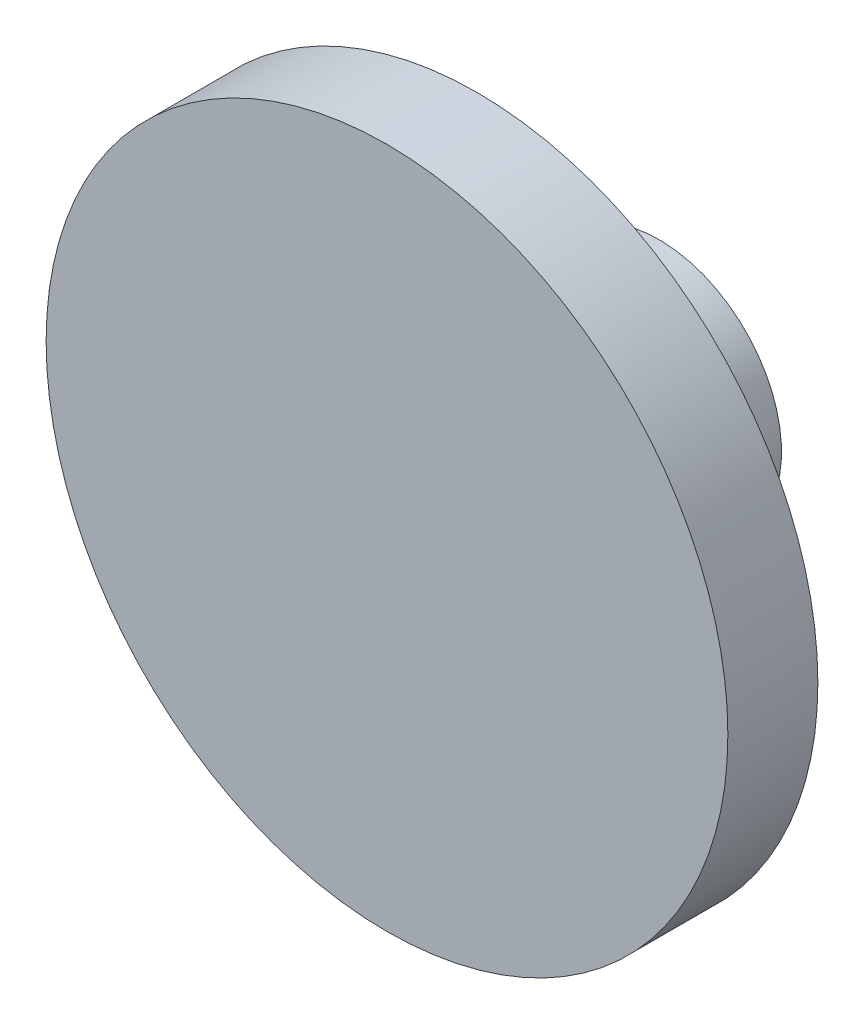
ISO-10303-21;
HEADER;
FILE_DESCRIPTION(('STEP AP214'),'2;1');
FILE_NAME('part.step','',(''),(''),'','','');
FILE_SCHEMA(('AUTOMOTIVE_DESIGN { 1 0 10303 214 1 1 1 1 }'));
ENDSEC;
DATA;
#1=APPLICATION_CONTEXT('core data for automotive mechanical design processes');
#2=APPLICATION_PROTOCOL_DEFINITION('international standard','automotive_design',2000,#1);
#3=PRODUCT_CONTEXT('',#1,'mechanical');
#4=PRODUCT('Part','Part','',(#3));
#5=PRODUCT_RELATED_PRODUCT_CATEGORY('part','',(#4));
#6=PRODUCT_DEFINITION_FORMATION('','',#4);
#7=PRODUCT_DEFINITION_CONTEXT('part definition',#1,'design');
#8=PRODUCT_DEFINITION('design','',#6,#7);
#9=PRODUCT_DEFINITION_SHAPE('','',#8);
#10=(LENGTH_UNIT() NAMED_UNIT(*) SI_UNIT(.MILLI.,.METRE.));
#11=(NAMED_UNIT(*) PLANE_ANGLE_UNIT() SI_UNIT($,.RADIAN.));
#12=(NAMED_UNIT(*) SI_UNIT($,.STERADIAN.) SOLID_ANGLE_UNIT());
#13=UNCERTAINTY_MEASURE_WITH_UNIT(LENGTH_MEASURE(1.E-05),#10,'distance_accuracy_value','');
#14=(GEOMETRIC_REPRESENTATION_CONTEXT(3) GLOBAL_UNCERTAINTY_ASSIGNED_CONTEXT((#13)) GLOBAL_UNIT_ASSIGNED_CONTEXT((#10,
#11,#12)) REPRESENTATION_CONTEXT('',''));
#15=CARTESIAN_POINT('',(0.,0.,0.));
#16=DIRECTION('',(0.,0.,1.));
#17=DIRECTION('',(1.,0.,0.));
#18=AXIS2_PLACEMENT_3D('',#15,#16,#17);
#19=CARTESIAN_POINT('',(0.,-5.2517767182519,35.5));
#20=DIRECTION('',(0.,0.,1.));
#21=DIRECTION('',(1.,0.,0.));
#22=AXIS2_PLACEMENT_3D('',#19,#20,#21);
#23=PLANE('',#22);
#24=CARTESIAN_POINT('',(0.,-5.2517767182519,35.5));
#25=DIRECTION('',(0.,0.,-1.));
#26=DIRECTION('',(-1.,0.,0.));
#27=AXIS2_PLACEMENT_3D('',#24,#25,#26);
#28=CIRCLE('',#27,44.5);
#29=CARTESIAN_POINT('',(-44.5,-5.2517767182519,35.5));
#30=VERTEX_POINT('',#29);
#31=EDGE_CURVE('E10',#30,#30,#28,.T.);
#32=ORIENTED_EDGE('',*,*,#31,.F.);
#33=EDGE_LOOP('',(#32));
#34=FACE_BOUND('',#33,.T.);
#35=ADVANCED_FACE('F34',(#34),#23,.T.);
#36=CARTESIAN_POINT('',(0.,-5.2517767182519,0.));
#37=DIRECTION('',(0.,0.,-1.));
#38=DIRECTION('',(-1.,0.,0.));
#39=AXIS2_PLACEMENT_3D('',#36,#37,#38);
#40=CYLINDRICAL_SURFACE('',#39,44.5);
#41=ORIENTED_EDGE('',*,*,#31,.T.);
#42=EDGE_LOOP('',(#41));
#43=FACE_BOUND('',#42,.T.);
#44=CARTESIAN_POINT('',(0.,-5.2517767182519,23.75));
#45=DIRECTION('',(0.,0.,-1.));
#46=DIRECTION('',(-1.,0.,0.));
#47=AXIS2_PLACEMENT_3D('',#44,#45,#46);
#48=CIRCLE('',#47,44.5);
#49=CARTESIAN_POINT('',(-44.5,-5.2517767182519,23.75));
#50=VERTEX_POINT('',#49);
#51=EDGE_CURVE('E40',#50,#50,#48,.T.);
#52=ORIENTED_EDGE('',*,*,#51,.F.);
#53=EDGE_LOOP('',(#52));
#54=FACE_BOUND('',#53,.T.);
#55=ADVANCED_FACE('F66',(#43,#54),#40,.T.);
#56=CARTESIAN_POINT('',(0.,39.2482232817481,23.75));
#57=DIRECTION('',(0.,0.,-1.));
#58=DIRECTION('',(-1.,0.,0.));
#59=AXIS2_PLACEMENT_3D('',#56,#57,#58);
#60=PLANE('',#59);
#61=ORIENTED_EDGE('',*,*,#51,.T.);
#62=EDGE_LOOP('',(#61));
#63=FACE_BOUND('',#62,.T.);
#64=CARTESIAN_POINT('',(0.,-5.2517767182519,23.75));
#65=DIRECTION('',(0.,0.,-1.));
#66=DIRECTION('',(-1.,0.,0.));
#67=AXIS2_PLACEMENT_3D('',#64,#65,#66);
#68=CIRCLE('',#67,16.);
#69=CARTESIAN_POINT('',(-16.,-5.2517767182519,23.75));
#70=VERTEX_POINT('',#69);
#71=EDGE_CURVE('E44',#70,#70,#68,.T.);
#72=ORIENTED_EDGE('',*,*,#71,.F.);
#73=EDGE_LOOP('',(#72));
#74=FACE_BOUND('',#73,.T.);
#75=ADVANCED_FACE('F58',(#63,#74),#60,.T.);
#76=CARTESIAN_POINT('',(0.,-5.2517767182519,0.));
#77=DIRECTION('',(0.,0.,-1.));
#78=DIRECTION('',(-1.,0.,0.));
#79=AXIS2_PLACEMENT_3D('',#76,#77,#78);
#80=CYLINDRICAL_SURFACE('',#79,16.);
#81=ORIENTED_EDGE('',*,*,#71,.T.);
#82=EDGE_LOOP('',(#81));
#83=FACE_BOUND('',#82,.T.);
#84=CARTESIAN_POINT('',(0.,-5.2517767182519,0.));
#85=DIRECTION('',(0.,0.,-1.));
#86=DIRECTION('',(-1.,0.,0.));
#87=AXIS2_PLACEMENT_3D('',#84,#85,#86);
#88=CIRCLE('',#87,16.);
#89=CARTESIAN_POINT('',(-16.,-5.2517767182519,0.));
#90=VERTEX_POINT('',#89);
#91=EDGE_CURVE('E48',#90,#90,#88,.T.);
#92=ORIENTED_EDGE('',*,*,#91,.F.);
#93=EDGE_LOOP('',(#92));
#94=FACE_BOUND('',#93,.T.);
#95=ADVANCED_FACE('F56',(#83,#94),#80,.T.);
#96=CARTESIAN_POINT('',(0.,10.7482232817481,0.));
#97=DIRECTION('',(0.,0.,-1.));
#98=DIRECTION('',(-1.,0.,0.));
#99=AXIS2_PLACEMENT_3D('',#96,#97,#98);
#100=PLANE('',#99);
#101=ORIENTED_EDGE('',*,*,#91,.T.);
#102=EDGE_LOOP('',(#101));
#103=FACE_BOUND('',#102,.T.);
#104=ADVANCED_FACE('F54',(#103),#100,.T.);
#105=CLOSED_SHELL('',(#35,#55,#75,#95,#104));
#106=MANIFOLD_SOLID_BREP('B2',#105);
#107=ADVANCED_BREP_SHAPE_REPRESENTATION('',(#18,#106),#14);
#108=SHAPE_DEFINITION_REPRESENTATION(#9,#107);
ENDSEC;
END-ISO-10303-21;
